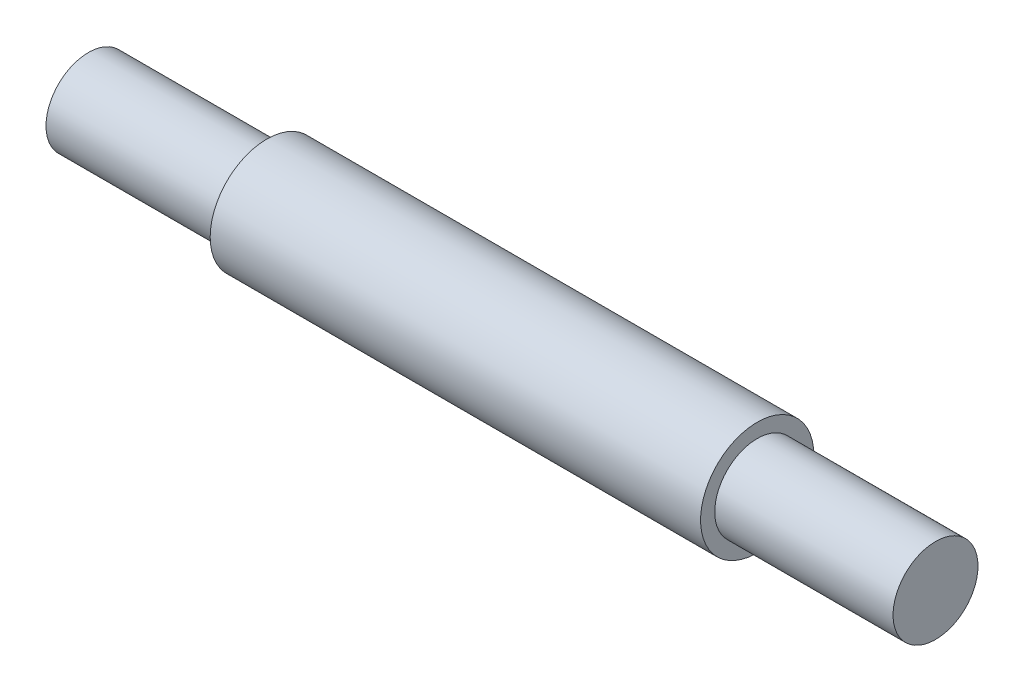
ISO-10303-21;
HEADER;
FILE_DESCRIPTION(('STEP AP214'),'2;1');
FILE_NAME('part.step','',(''),(''),'','','');
FILE_SCHEMA(('AUTOMOTIVE_DESIGN { 1 0 10303 214 1 1 1 1 }'));
ENDSEC;
DATA;
#1=APPLICATION_CONTEXT('core data for automotive mechanical design processes');
#2=APPLICATION_PROTOCOL_DEFINITION('international standard','automotive_design',2000,#1);
#3=PRODUCT_CONTEXT('',#1,'mechanical');
#4=PRODUCT('Part','Part','',(#3));
#5=PRODUCT_RELATED_PRODUCT_CATEGORY('part','',(#4));
#6=PRODUCT_DEFINITION_FORMATION('','',#4);
#7=PRODUCT_DEFINITION_CONTEXT('part definition',#1,'design');
#8=PRODUCT_DEFINITION('design','',#6,#7);
#9=PRODUCT_DEFINITION_SHAPE('','',#8);
#10=(LENGTH_UNIT() NAMED_UNIT(*) SI_UNIT(.MILLI.,.METRE.));
#11=(NAMED_UNIT(*) PLANE_ANGLE_UNIT() SI_UNIT($,.RADIAN.));
#12=(NAMED_UNIT(*) SI_UNIT($,.STERADIAN.) SOLID_ANGLE_UNIT());
#13=UNCERTAINTY_MEASURE_WITH_UNIT(LENGTH_MEASURE(1.E-05),#10,'distance_accuracy_value','');
#14=(GEOMETRIC_REPRESENTATION_CONTEXT(3) GLOBAL_UNCERTAINTY_ASSIGNED_CONTEXT((#13)) GLOBAL_UNIT_ASSIGNED_CONTEXT((#10,
#11,#12)) REPRESENTATION_CONTEXT('',''));
#15=CARTESIAN_POINT('',(0.,0.,0.));
#16=DIRECTION('',(0.,0.,1.));
#17=DIRECTION('',(1.,0.,0.));
#18=AXIS2_PLACEMENT_3D('',#15,#16,#17);
#19=CARTESIAN_POINT('',(-40.,0.,0.));
#20=DIRECTION('',(1.,0.,0.));
#21=DIRECTION('',(0.,0.,-1.));
#22=AXIS2_PLACEMENT_3D('',#19,#20,#21);
#23=CYLINDRICAL_SURFACE('',#22,6.35);
#24=CARTESIAN_POINT('',(-20.,0.,0.));
#25=DIRECTION('',(-1.,0.,0.));
#26=DIRECTION('',(0.,0.,1.));
#27=AXIS2_PLACEMENT_3D('',#24,#25,#26);
#28=CIRCLE('',#27,6.35);
#29=CARTESIAN_POINT('',(-20.,0.,6.34999999999997));
#30=VERTEX_POINT('',#29);
#31=EDGE_CURVE('E11',#30,#30,#28,.F.);
#32=ORIENTED_EDGE('',*,*,#31,.T.);
#33=EDGE_LOOP('',(#32));
#34=FACE_BOUND('',#33,.T.);
#35=CARTESIAN_POINT('',(35.,0.,0.));
#36=DIRECTION('',(1.,0.,0.));
#37=DIRECTION('',(0.,0.,-1.));
#38=AXIS2_PLACEMENT_3D('',#35,#36,#37);
#39=CIRCLE('',#38,6.35);
#40=CARTESIAN_POINT('',(35.,0.,-6.35000000000005));
#41=VERTEX_POINT('',#40);
#42=EDGE_CURVE('E37',#41,#41,#39,.F.);
#43=ORIENTED_EDGE('',*,*,#42,.T.);
#44=EDGE_LOOP('',(#43));
#45=FACE_BOUND('',#44,.T.);
#46=ADVANCED_FACE('F34',(#34,#45),#23,.T.);
#47=CARTESIAN_POINT('',(-20.,0.,0.));
#48=DIRECTION('',(-1.,0.,0.));
#49=DIRECTION('',(0.,0.,1.));
#50=AXIS2_PLACEMENT_3D('',#47,#48,#49);
#51=PLANE('',#50);
#52=ORIENTED_EDGE('',*,*,#31,.F.);
#53=EDGE_LOOP('',(#52));
#54=FACE_BOUND('',#53,.T.);
#55=CARTESIAN_POINT('',(-20.,0.,0.));
#56=DIRECTION('',(-1.,0.,0.));
#57=DIRECTION('',(0.,0.,1.));
#58=AXIS2_PLACEMENT_3D('',#55,#56,#57);
#59=CIRCLE('',#58,4.7625);
#60=CARTESIAN_POINT('',(-20.,0.,4.76249999999997));
#61=VERTEX_POINT('',#60);
#62=EDGE_CURVE('E41',#61,#61,#59,.T.);
#63=ORIENTED_EDGE('',*,*,#62,.F.);
#64=EDGE_LOOP('',(#63));
#65=FACE_BOUND('',#64,.T.);
#66=ADVANCED_FACE('F77',(#54,#65),#51,.T.);
#67=CARTESIAN_POINT('',(-20.,0.,0.));
#68=DIRECTION('',(-1.,0.,0.));
#69=DIRECTION('',(0.,0.,1.));
#70=AXIS2_PLACEMENT_3D('',#67,#68,#69);
#71=CYLINDRICAL_SURFACE('',#70,4.7625);
#72=ORIENTED_EDGE('',*,*,#62,.T.);
#73=EDGE_LOOP('',(#72));
#74=FACE_BOUND('',#73,.T.);
#75=CARTESIAN_POINT('',(-40.,0.,0.));
#76=DIRECTION('',(-1.,0.,0.));
#77=DIRECTION('',(0.,0.,1.));
#78=AXIS2_PLACEMENT_3D('',#75,#76,#77);
#79=CIRCLE('',#78,4.7625);
#80=CARTESIAN_POINT('',(-40.,0.,4.76249999999999));
#81=VERTEX_POINT('',#80);
#82=EDGE_CURVE('E45',#81,#81,#79,.T.);
#83=ORIENTED_EDGE('',*,*,#82,.F.);
#84=EDGE_LOOP('',(#83));
#85=FACE_BOUND('',#84,.T.);
#86=ADVANCED_FACE('F73',(#74,#85),#71,.T.);
#87=CARTESIAN_POINT('',(-40.,0.,0.));
#88=DIRECTION('',(1.,0.,0.));
#89=DIRECTION('',(0.,0.,-1.));
#90=AXIS2_PLACEMENT_3D('',#87,#88,#89);
#91=PLANE('',#90);
#92=ORIENTED_EDGE('',*,*,#82,.T.);
#93=EDGE_LOOP('',(#92));
#94=FACE_BOUND('',#93,.T.);
#95=ADVANCED_FACE('F65',(#94),#91,.F.);
#96=CARTESIAN_POINT('',(35.,0.,0.));
#97=DIRECTION('',(1.,0.,0.));
#98=DIRECTION('',(0.,0.,-1.));
#99=AXIS2_PLACEMENT_3D('',#96,#97,#98);
#100=PLANE('',#99);
#101=ORIENTED_EDGE('',*,*,#42,.F.);
#102=EDGE_LOOP('',(#101));
#103=FACE_BOUND('',#102,.T.);
#104=CARTESIAN_POINT('',(35.,0.,0.));
#105=DIRECTION('',(1.,0.,0.));
#106=DIRECTION('',(0.,0.,-1.));
#107=AXIS2_PLACEMENT_3D('',#104,#105,#106);
#108=CIRCLE('',#107,4.7625);
#109=CARTESIAN_POINT('',(35.,0.,-4.76250000000005));
#110=VERTEX_POINT('',#109);
#111=EDGE_CURVE('E53',#110,#110,#108,.T.);
#112=ORIENTED_EDGE('',*,*,#111,.F.);
#113=EDGE_LOOP('',(#112));
#114=FACE_BOUND('',#113,.T.);
#115=ADVANCED_FACE('F61',(#103,#114),#100,.T.);
#116=CARTESIAN_POINT('',(35.,0.,0.));
#117=DIRECTION('',(1.,0.,0.));
#118=DIRECTION('',(0.,0.,-1.));
#119=AXIS2_PLACEMENT_3D('',#116,#117,#118);
#120=CYLINDRICAL_SURFACE('',#119,4.7625);
#121=ORIENTED_EDGE('',*,*,#111,.T.);
#122=EDGE_LOOP('',(#121));
#123=FACE_BOUND('',#122,.T.);
#124=CARTESIAN_POINT('',(55.,0.,0.));
#125=DIRECTION('',(1.,0.,0.));
#126=DIRECTION('',(0.,0.,-1.));
#127=AXIS2_PLACEMENT_3D('',#124,#125,#126);
#128=CIRCLE('',#127,4.7625);
#129=CARTESIAN_POINT('',(55.,0.,-4.76250000000001));
#130=VERTEX_POINT('',#129);
#131=EDGE_CURVE('E50',#130,#130,#128,.T.);
#132=ORIENTED_EDGE('',*,*,#131,.F.);
#133=EDGE_LOOP('',(#132));
#134=FACE_BOUND('',#133,.T.);
#135=ADVANCED_FACE('F64',(#123,#134),#120,.T.);
#136=CARTESIAN_POINT('',(55.,0.,0.));
#137=DIRECTION('',(1.,0.,0.));
#138=DIRECTION('',(0.,0.,-1.));
#139=AXIS2_PLACEMENT_3D('',#136,#137,#138);
#140=PLANE('',#139);
#141=ORIENTED_EDGE('',*,*,#131,.T.);
#142=EDGE_LOOP('',(#141));
#143=FACE_BOUND('',#142,.T.);
#144=ADVANCED_FACE('F71',(#143),#140,.T.);
#145=CLOSED_SHELL('',(#46,#66,#86,#95,#115,#135,#144));
#146=MANIFOLD_SOLID_BREP('B2',#145);
#147=ADVANCED_BREP_SHAPE_REPRESENTATION('',(#18,#146),#14);
#148=SHAPE_DEFINITION_REPRESENTATION(#9,#147);
ENDSEC;
END-ISO-10303-21;
